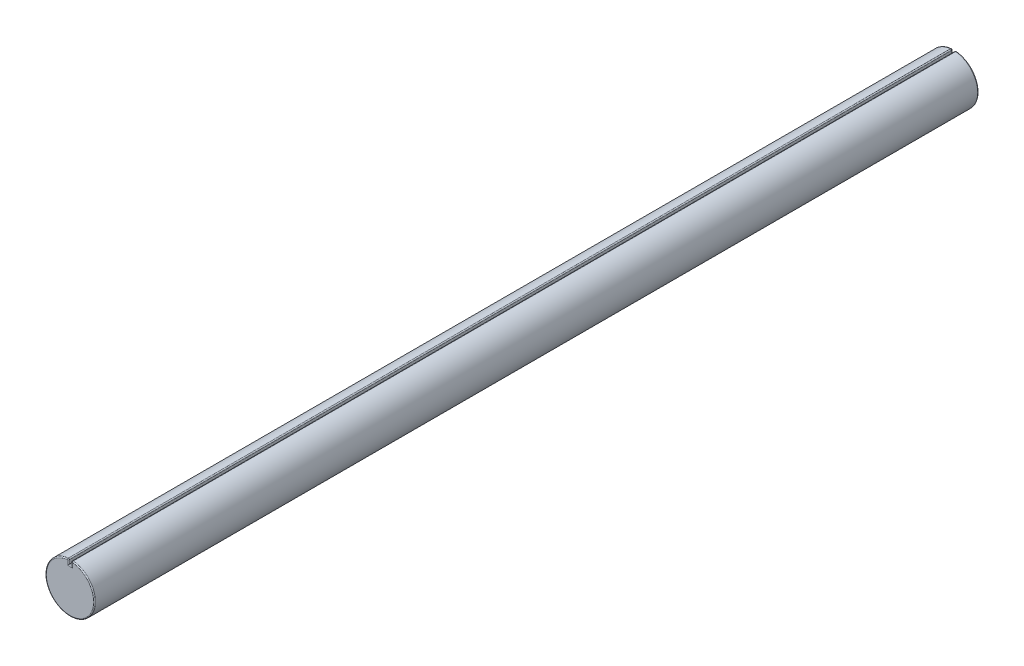
ISO-10303-21;
HEADER;
FILE_DESCRIPTION(('STEP AP214'),'2;1');
FILE_NAME('part.step','',(''),(''),'','','');
FILE_SCHEMA(('AUTOMOTIVE_DESIGN { 1 0 10303 214 1 1 1 1 }'));
ENDSEC;
DATA;
#1=APPLICATION_CONTEXT('core data for automotive mechanical design processes');
#2=APPLICATION_PROTOCOL_DEFINITION('international standard','automotive_design',2000,#1);
#3=PRODUCT_CONTEXT('',#1,'mechanical');
#4=PRODUCT('Part','Part','',(#3));
#5=PRODUCT_RELATED_PRODUCT_CATEGORY('part','',(#4));
#6=PRODUCT_DEFINITION_FORMATION('','',#4);
#7=PRODUCT_DEFINITION_CONTEXT('part definition',#1,'design');
#8=PRODUCT_DEFINITION('design','',#6,#7);
#9=PRODUCT_DEFINITION_SHAPE('','',#8);
#10=(LENGTH_UNIT() NAMED_UNIT(*) SI_UNIT(.MILLI.,.METRE.));
#11=(NAMED_UNIT(*) PLANE_ANGLE_UNIT() SI_UNIT($,.RADIAN.));
#12=(NAMED_UNIT(*) SI_UNIT($,.STERADIAN.) SOLID_ANGLE_UNIT());
#13=UNCERTAINTY_MEASURE_WITH_UNIT(LENGTH_MEASURE(1.E-05),#10,'distance_accuracy_value','');
#14=(GEOMETRIC_REPRESENTATION_CONTEXT(3) GLOBAL_UNCERTAINTY_ASSIGNED_CONTEXT((#13)) GLOBAL_UNIT_ASSIGNED_CONTEXT((#10,
#11,#12)) REPRESENTATION_CONTEXT('',''));
#15=CARTESIAN_POINT('',(0.,0.,0.));
#16=DIRECTION('',(0.,0.,1.));
#17=DIRECTION('',(1.,0.,0.));
#18=AXIS2_PLACEMENT_3D('',#15,#16,#17);
#19=CARTESIAN_POINT('',(0.,0.,900.));
#20=DIRECTION('',(0.,0.,-1.));
#21=DIRECTION('',(-1.,0.,0.));
#22=AXIS2_PLACEMENT_3D('',#19,#20,#21);
#23=CYLINDRICAL_SURFACE('',#22,25.);
#24=DIRECTION('',(0.,0.,-1.));
#25=VECTOR('',#24,1.);
#26=CARTESIAN_POINT('',(-2.60416666666667,24.86399637975,900.));
#27=LINE('',#26,#25);
#28=CARTESIAN_POINT('',(-2.60416666666666,24.86399637975,899.));
#29=VERTEX_POINT('',#28);
#30=CARTESIAN_POINT('',(-2.60416666666666,24.86399637975,1.));
#31=VERTEX_POINT('',#30);
#32=EDGE_CURVE('E45',#29,#31,#27,.T.);
#33=ORIENTED_EDGE('',*,*,#32,.T.);
#34=CARTESIAN_POINT('',(0.,0.,1.));
#35=DIRECTION('',(0.,0.,1.));
#36=DIRECTION('',(1.,0.,0.));
#37=AXIS2_PLACEMENT_3D('',#34,#35,#36);
#38=CIRCLE('',#37,25.);
#39=CARTESIAN_POINT('',(2.60416666666667,24.86399637975,1.));
#40=VERTEX_POINT('',#39);
#41=EDGE_CURVE('E11',#31,#40,#38,.T.);
#42=ORIENTED_EDGE('',*,*,#41,.T.);
#43=DIRECTION('',(0.,0.,-1.));
#44=VECTOR('',#43,1.);
#45=CARTESIAN_POINT('',(2.60416666666667,24.86399637975,900.));
#46=LINE('',#45,#44);
#47=CARTESIAN_POINT('',(2.60416666666667,24.86399637975,899.));
#48=VERTEX_POINT('',#47);
#49=EDGE_CURVE('E179',#40,#48,#46,.F.);
#50=ORIENTED_EDGE('',*,*,#49,.T.);
#51=CARTESIAN_POINT('',(0.,0.,899.));
#52=DIRECTION('',(0.,0.,1.));
#53=DIRECTION('',(1.,0.,0.));
#54=AXIS2_PLACEMENT_3D('',#51,#52,#53);
#55=CIRCLE('',#54,25.);
#56=EDGE_CURVE('E177',#48,#29,#55,.F.);
#57=ORIENTED_EDGE('',*,*,#56,.T.);
#58=EDGE_LOOP('',(#33,#42,#50,#57));
#59=FACE_BOUND('',#58,.T.);
#60=ADVANCED_FACE('F36',(#59),#23,.T.);
#61=CARTESIAN_POINT('',(0.,0.,900.));
#62=DIRECTION('',(0.,0.,1.));
#63=DIRECTION('',(1.,0.,0.));
#64=AXIS2_PLACEMENT_3D('',#61,#62,#63);
#65=PLANE('',#64);
#66=DIRECTION('',(1.,0.,0.));
#67=VECTOR('',#66,1.);
#68=CARTESIAN_POINT('',(-1.5,19.,900.));
#69=LINE('',#68,#67);
#70=CARTESIAN_POINT('',(2.5,19.,900.));
#71=VERTEX_POINT('',#70);
#72=CARTESIAN_POINT('',(-2.5,19.,900.));
#73=VERTEX_POINT('',#72);
#74=EDGE_CURVE('E172',#71,#73,#69,.F.);
#75=ORIENTED_EDGE('',*,*,#74,.T.);
#76=DIRECTION('',(0.,-1.,0.));
#77=VECTOR('',#76,1.);
#78=CARTESIAN_POINT('',(-2.5,24.9549594269356,900.));
#79=LINE('',#78,#77);
#80=CARTESIAN_POINT('',(-2.5,23.86943652456,900.));
#81=VERTEX_POINT('',#80);
#82=EDGE_CURVE('E174',#73,#81,#79,.F.);
#83=ORIENTED_EDGE('',*,*,#82,.T.);
#84=CARTESIAN_POINT('',(0.,0.,900.));
#85=DIRECTION('',(0.,0.,1.));
#86=DIRECTION('',(1.,0.,0.));
#87=AXIS2_PLACEMENT_3D('',#84,#85,#86);
#88=CIRCLE('',#87,24.);
#89=CARTESIAN_POINT('',(2.5,23.86943652456,900.));
#90=VERTEX_POINT('',#89);
#91=EDGE_CURVE('E168',#81,#90,#88,.T.);
#92=ORIENTED_EDGE('',*,*,#91,.T.);
#93=DIRECTION('',(0.,1.,0.));
#94=VECTOR('',#93,1.);
#95=CARTESIAN_POINT('',(2.5,20.,900.));
#96=LINE('',#95,#94);
#97=EDGE_CURVE('E170',#90,#71,#96,.F.);
#98=ORIENTED_EDGE('',*,*,#97,.T.);
#99=EDGE_LOOP('',(#75,#83,#92,#98));
#100=FACE_BOUND('',#99,.T.);
#101=ADVANCED_FACE('F266',(#100),#65,.T.);
#102=CARTESIAN_POINT('',(0.,0.,0.));
#103=DIRECTION('',(0.,0.,1.));
#104=DIRECTION('',(1.,0.,0.));
#105=AXIS2_PLACEMENT_3D('',#102,#103,#104);
#106=PLANE('',#105);
#107=DIRECTION('',(1.,0.,0.));
#108=VECTOR('',#107,1.);
#109=CARTESIAN_POINT('',(0.,19.,0.));
#110=LINE('',#109,#108);
#111=CARTESIAN_POINT('',(-2.5,19.,0.));
#112=VERTEX_POINT('',#111);
#113=CARTESIAN_POINT('',(2.5,19.,0.));
#114=VERTEX_POINT('',#113);
#115=EDGE_CURVE('E120',#112,#114,#110,.T.);
#116=ORIENTED_EDGE('',*,*,#115,.T.);
#117=DIRECTION('',(0.,1.,0.));
#118=VECTOR('',#117,1.);
#119=CARTESIAN_POINT('',(2.50000000000001,0.,0.));
#120=LINE('',#119,#118);
#121=CARTESIAN_POINT('',(2.5,23.86943652456,0.));
#122=VERTEX_POINT('',#121);
#123=EDGE_CURVE('E119',#114,#122,#120,.T.);
#124=ORIENTED_EDGE('',*,*,#123,.T.);
#125=CARTESIAN_POINT('',(0.,0.,0.));
#126=DIRECTION('',(0.,0.,1.));
#127=DIRECTION('',(1.,0.,0.));
#128=AXIS2_PLACEMENT_3D('',#125,#126,#127);
#129=CIRCLE('',#128,24.);
#130=CARTESIAN_POINT('',(-2.5,23.86943652456,0.));
#131=VERTEX_POINT('',#130);
#132=EDGE_CURVE('E113',#122,#131,#129,.F.);
#133=ORIENTED_EDGE('',*,*,#132,.T.);
#134=DIRECTION('',(0.,-1.,0.));
#135=VECTOR('',#134,1.);
#136=CARTESIAN_POINT('',(-2.49999999999999,0.,0.));
#137=LINE('',#136,#135);
#138=EDGE_CURVE('E116',#131,#112,#137,.T.);
#139=ORIENTED_EDGE('',*,*,#138,.T.);
#140=EDGE_LOOP('',(#116,#124,#133,#139));
#141=FACE_BOUND('',#140,.T.);
#142=ADVANCED_FACE('F114',(#141),#106,.F.);
#143=CARTESIAN_POINT('',(1.5,30.,0.));
#144=DIRECTION('',(1.,0.,0.));
#145=DIRECTION('',(0.,1.,0.));
#146=AXIS2_PLACEMENT_3D('',#143,#144,#145);
#147=PLANE('',#146);
#148=DIRECTION('',(0.,0.,-1.));
#149=VECTOR('',#148,1.);
#150=CARTESIAN_POINT('',(1.5,23.86943652456,0.));
#151=LINE('',#150,#149);
#152=CARTESIAN_POINT('',(1.5,23.86943652456,899.));
#153=VERTEX_POINT('',#152);
#154=CARTESIAN_POINT('',(1.5,23.86943652456,1.));
#155=VERTEX_POINT('',#154);
#156=EDGE_CURVE('E151',#153,#155,#151,.T.);
#157=ORIENTED_EDGE('',*,*,#156,.T.);
#158=DIRECTION('',(0.,1.,0.));
#159=VECTOR('',#158,1.);
#160=CARTESIAN_POINT('',(1.5,30.,1.));
#161=LINE('',#160,#159);
#162=CARTESIAN_POINT('',(1.5,20.,1.));
#163=VERTEX_POINT('',#162);
#164=EDGE_CURVE('E155',#155,#163,#161,.F.);
#165=ORIENTED_EDGE('',*,*,#164,.T.);
#166=DIRECTION('',(0.,0.,1.));
#167=VECTOR('',#166,1.);
#168=CARTESIAN_POINT('',(1.5,20.,0.));
#169=LINE('',#168,#167);
#170=CARTESIAN_POINT('',(1.5,20.,899.));
#171=VERTEX_POINT('',#170);
#172=EDGE_CURVE('E142',#163,#171,#169,.T.);
#173=ORIENTED_EDGE('',*,*,#172,.T.);
#174=DIRECTION('',(0.,1.,0.));
#175=VECTOR('',#174,1.);
#176=CARTESIAN_POINT('',(1.5,24.9549594269356,899.));
#177=LINE('',#176,#175);
#178=EDGE_CURVE('E153',#171,#153,#177,.T.);
#179=ORIENTED_EDGE('',*,*,#178,.T.);
#180=EDGE_LOOP('',(#157,#165,#173,#179));
#181=FACE_BOUND('',#180,.T.);
#182=ADVANCED_FACE('F239',(#181),#147,.F.);
#183=CARTESIAN_POINT('',(-1.5,30.,0.));
#184=DIRECTION('',(-1.,0.,0.));
#185=DIRECTION('',(0.,-1.,0.));
#186=AXIS2_PLACEMENT_3D('',#183,#184,#185);
#187=PLANE('',#186);
#188=DIRECTION('',(0.,0.,-1.));
#189=VECTOR('',#188,1.);
#190=CARTESIAN_POINT('',(-1.5,23.86943652456,0.));
#191=LINE('',#190,#189);
#192=CARTESIAN_POINT('',(-1.5,23.86943652456,1.));
#193=VERTEX_POINT('',#192);
#194=CARTESIAN_POINT('',(-1.5,23.86943652456,899.));
#195=VERTEX_POINT('',#194);
#196=EDGE_CURVE('E164',#193,#195,#191,.F.);
#197=ORIENTED_EDGE('',*,*,#196,.T.);
#198=DIRECTION('',(0.,-1.,0.));
#199=VECTOR('',#198,1.);
#200=CARTESIAN_POINT('',(-1.5,20.,899.));
#201=LINE('',#200,#199);
#202=CARTESIAN_POINT('',(-1.5,20.,899.));
#203=VERTEX_POINT('',#202);
#204=EDGE_CURVE('E166',#195,#203,#201,.T.);
#205=ORIENTED_EDGE('',*,*,#204,.T.);
#206=DIRECTION('',(0.,0.,1.));
#207=VECTOR('',#206,1.);
#208=CARTESIAN_POINT('',(-1.5,20.,0.));
#209=LINE('',#208,#207);
#210=CARTESIAN_POINT('',(-1.5,20.,1.));
#211=VERTEX_POINT('',#210);
#212=EDGE_CURVE('E145',#211,#203,#209,.T.);
#213=ORIENTED_EDGE('',*,*,#212,.F.);
#214=DIRECTION('',(0.,-1.,0.));
#215=VECTOR('',#214,1.);
#216=CARTESIAN_POINT('',(-1.5,30.,1.));
#217=LINE('',#216,#215);
#218=EDGE_CURVE('E162',#211,#193,#217,.F.);
#219=ORIENTED_EDGE('',*,*,#218,.T.);
#220=EDGE_LOOP('',(#197,#205,#213,#219));
#221=FACE_BOUND('',#220,.T.);
#222=ADVANCED_FACE('F380',(#221),#187,.F.);
#223=CARTESIAN_POINT('',(-1.5,20.,0.));
#224=DIRECTION('',(0.,-1.,0.));
#225=DIRECTION('',(0.,0.,-1.));
#226=AXIS2_PLACEMENT_3D('',#223,#224,#225);
#227=PLANE('',#226);
#228=ORIENTED_EDGE('',*,*,#172,.F.);
#229=DIRECTION('',(1.,0.,0.));
#230=VECTOR('',#229,1.);
#231=CARTESIAN_POINT('',(-1.5,20.,1.));
#232=LINE('',#231,#230);
#233=EDGE_CURVE('E160',#163,#211,#232,.F.);
#234=ORIENTED_EDGE('',*,*,#233,.T.);
#235=ORIENTED_EDGE('',*,*,#212,.T.);
#236=DIRECTION('',(1.,0.,0.));
#237=VECTOR('',#236,1.);
#238=CARTESIAN_POINT('',(1.5,20.,899.));
#239=LINE('',#238,#237);
#240=EDGE_CURVE('E158',#203,#171,#239,.T.);
#241=ORIENTED_EDGE('',*,*,#240,.T.);
#242=EDGE_LOOP('',(#228,#234,#235,#241));
#243=FACE_BOUND('',#242,.T.);
#244=ADVANCED_FACE('F224',(#243),#227,.F.);
#245=CARTESIAN_POINT('',(-2.5,30.,899.));
#246=DIRECTION('',(0.,1.,0.));
#247=DIRECTION('',(-1.,0.,0.));
#248=AXIS2_PLACEMENT_3D('',#245,#246,#247);
#249=CYLINDRICAL_SURFACE('',#248,1.);
#250=CARTESIAN_POINT('',(-2.5,23.86943652456,899.));
#251=DIRECTION('',(0.,1.,0.));
#252=DIRECTION('',(0.,0.,1.));
#253=AXIS2_PLACEMENT_3D('',#250,#251,#252);
#254=CIRCLE('',#253,1.);
#255=EDGE_CURVE('E40',#81,#195,#254,.T.);
#256=ORIENTED_EDGE('',*,*,#255,.F.);
#257=ORIENTED_EDGE('',*,*,#82,.F.);
#258=CARTESIAN_POINT('',(-2.5,19.,899.));
#259=DIRECTION('',(-0.707106781186548,0.707106781186547,0.));
#260=DIRECTION('',(0.707106781186547,0.707106781186548,0.));
#261=AXIS2_PLACEMENT_3D('',#258,#259,#260);
#262=ELLIPSE('',#261,1.41421356237309,1.);
#263=EDGE_CURVE('E209',#203,#73,#262,.F.);
#264=ORIENTED_EDGE('',*,*,#263,.F.);
#265=ORIENTED_EDGE('',*,*,#204,.F.);
#266=EDGE_LOOP('',(#256,#257,#264,#265));
#267=FACE_BOUND('',#266,.T.);
#268=ADVANCED_FACE('F38',(#267),#249,.T.);
#269=CARTESIAN_POINT('',(-2.5,23.86943652456,899.));
#270=DIRECTION('',(0.,0.,1.));
#271=DIRECTION('',(1.,0.,0.));
#272=AXIS2_PLACEMENT_3D('',#269,#270,#271);
#273=SPHERICAL_SURFACE('',#272,1.);
#274=CARTESIAN_POINT('',(-2.5,23.86943652456,899.));
#275=DIRECTION('',(0.994559855190001,0.104166666666666,0.));
#276=DIRECTION('',(-0.104166666666666,0.994559855190001,0.));
#277=AXIS2_PLACEMENT_3D('',#274,#275,#276);
#278=CIRCLE('',#277,1.);
#279=EDGE_CURVE('E204',#81,#29,#278,.F.);
#280=ORIENTED_EDGE('',*,*,#279,.F.);
#281=ORIENTED_EDGE('',*,*,#255,.T.);
#282=CARTESIAN_POINT('',(-2.5,23.86943652456,899.));
#283=DIRECTION('',(0.,0.,1.));
#284=DIRECTION('',(1.,0.,0.));
#285=AXIS2_PLACEMENT_3D('',#282,#283,#284);
#286=CIRCLE('',#285,1.);
#287=EDGE_CURVE('E207',#29,#195,#286,.F.);
#288=ORIENTED_EDGE('',*,*,#287,.F.);
#289=EDGE_LOOP('',(#280,#281,#288));
#290=FACE_BOUND('',#289,.T.);
#291=ADVANCED_FACE('F360',(#290),#273,.T.);
#292=CARTESIAN_POINT('',(-1.5,19.,899.));
#293=DIRECTION('',(-1.,0.,0.));
#294=DIRECTION('',(0.,0.,1.));
#295=AXIS2_PLACEMENT_3D('',#292,#293,#294);
#296=CYLINDRICAL_SURFACE('',#295,1.);
#297=ORIENTED_EDGE('',*,*,#263,.T.);
#298=ORIENTED_EDGE('',*,*,#74,.F.);
#299=CARTESIAN_POINT('',(2.5,19.,899.));
#300=DIRECTION('',(-0.707106781186547,-0.707106781186548,0.));
#301=DIRECTION('',(-0.707106781186548,0.707106781186547,0.));
#302=AXIS2_PLACEMENT_3D('',#299,#300,#301);
#303=ELLIPSE('',#302,1.4142135623731,1.);
#304=EDGE_CURVE('E201',#171,#71,#303,.F.);
#305=ORIENTED_EDGE('',*,*,#304,.F.);
#306=ORIENTED_EDGE('',*,*,#240,.F.);
#307=EDGE_LOOP('',(#297,#298,#305,#306));
#308=FACE_BOUND('',#307,.T.);
#309=ADVANCED_FACE('F231',(#308),#296,.T.);
#310=CARTESIAN_POINT('',(-2.5,23.86943652456,900.));
#311=DIRECTION('',(0.,0.,-1.));
#312=DIRECTION('',(-1.,0.,0.));
#313=AXIS2_PLACEMENT_3D('',#310,#311,#312);
#314=CYLINDRICAL_SURFACE('',#313,1.);
#315=ORIENTED_EDGE('',*,*,#287,.T.);
#316=ORIENTED_EDGE('',*,*,#196,.F.);
#317=CARTESIAN_POINT('',(-2.5,23.86943652456,1.));
#318=DIRECTION('',(0.,0.,-1.));
#319=DIRECTION('',(-1.,0.,0.));
#320=AXIS2_PLACEMENT_3D('',#317,#318,#319);
#321=CIRCLE('',#320,1.);
#322=EDGE_CURVE('E133',#31,#193,#321,.T.);
#323=ORIENTED_EDGE('',*,*,#322,.F.);
#324=ORIENTED_EDGE('',*,*,#32,.F.);
#325=EDGE_LOOP('',(#315,#316,#323,#324));
#326=FACE_BOUND('',#325,.T.);
#327=ADVANCED_FACE('F344',(#326),#314,.T.);
#328=CARTESIAN_POINT('',(0.,0.,899.));
#329=DIRECTION('',(0.,0.,1.));
#330=DIRECTION('',(1.,0.,0.));
#331=AXIS2_PLACEMENT_3D('',#328,#329,#330);
#332=TOROIDAL_SURFACE('',#331,24.,1.);
#333=ORIENTED_EDGE('',*,*,#279,.T.);
#334=ORIENTED_EDGE('',*,*,#56,.F.);
#335=CARTESIAN_POINT('',(2.5,23.86943652456,899.));
#336=DIRECTION('',(-0.994559855190001,0.104166666666666,0.));
#337=DIRECTION('',(-0.104166666666666,-0.994559855190001,0.));
#338=AXIS2_PLACEMENT_3D('',#335,#336,#337);
#339=CIRCLE('',#338,1.);
#340=EDGE_CURVE('E197',#90,#48,#339,.T.);
#341=ORIENTED_EDGE('',*,*,#340,.F.);
#342=ORIENTED_EDGE('',*,*,#91,.F.);
#343=EDGE_LOOP('',(#333,#334,#341,#342));
#344=FACE_BOUND('',#343,.T.);
#345=ADVANCED_FACE('F254',(#344),#332,.T.);
#346=CARTESIAN_POINT('',(2.5,30.,899.));
#347=DIRECTION('',(0.,-1.,0.));
#348=DIRECTION('',(1.,0.,0.));
#349=AXIS2_PLACEMENT_3D('',#346,#347,#348);
#350=CYLINDRICAL_SURFACE('',#349,1.);
#351=ORIENTED_EDGE('',*,*,#304,.T.);
#352=ORIENTED_EDGE('',*,*,#97,.F.);
#353=CARTESIAN_POINT('',(2.5,23.86943652456,899.));
#354=DIRECTION('',(0.,1.,0.));
#355=DIRECTION('',(0.,0.,1.));
#356=AXIS2_PLACEMENT_3D('',#353,#354,#355);
#357=CIRCLE('',#356,1.);
#358=EDGE_CURVE('E136',#153,#90,#357,.T.);
#359=ORIENTED_EDGE('',*,*,#358,.F.);
#360=ORIENTED_EDGE('',*,*,#178,.F.);
#361=EDGE_LOOP('',(#351,#352,#359,#360));
#362=FACE_BOUND('',#361,.T.);
#363=ADVANCED_FACE('F236',(#362),#350,.T.);
#364=CARTESIAN_POINT('',(-2.5,23.86943652456,1.));
#365=DIRECTION('',(0.,0.,1.));
#366=DIRECTION('',(1.,0.,0.));
#367=AXIS2_PLACEMENT_3D('',#364,#365,#366);
#368=SPHERICAL_SURFACE('',#367,1.);
#369=CARTESIAN_POINT('',(-2.5,23.86943652456,1.));
#370=DIRECTION('',(0.994559855190001,0.104166666666666,0.));
#371=DIRECTION('',(-0.104166666666666,0.994559855190001,0.));
#372=AXIS2_PLACEMENT_3D('',#369,#370,#371);
#373=CIRCLE('',#372,1.);
#374=EDGE_CURVE('E122',#31,#131,#373,.F.);
#375=ORIENTED_EDGE('',*,*,#374,.F.);
#376=ORIENTED_EDGE('',*,*,#322,.T.);
#377=CARTESIAN_POINT('',(-2.5,23.86943652456,1.));
#378=DIRECTION('',(0.,1.,0.));
#379=DIRECTION('',(0.,0.,1.));
#380=AXIS2_PLACEMENT_3D('',#377,#378,#379);
#381=CIRCLE('',#380,1.);
#382=EDGE_CURVE('E128',#131,#193,#381,.F.);
#383=ORIENTED_EDGE('',*,*,#382,.F.);
#384=EDGE_LOOP('',(#375,#376,#383));
#385=FACE_BOUND('',#384,.T.);
#386=ADVANCED_FACE('F132',(#385),#368,.T.);
#387=CARTESIAN_POINT('',(2.5,23.86943652456,899.));
#388=DIRECTION('',(0.,0.,1.));
#389=DIRECTION('',(1.,0.,0.));
#390=AXIS2_PLACEMENT_3D('',#387,#388,#389);
#391=SPHERICAL_SURFACE('',#390,1.);
#392=ORIENTED_EDGE('',*,*,#358,.T.);
#393=ORIENTED_EDGE('',*,*,#340,.T.);
#394=CARTESIAN_POINT('',(2.5,23.86943652456,899.));
#395=DIRECTION('',(0.,0.,1.));
#396=DIRECTION('',(1.,0.,0.));
#397=AXIS2_PLACEMENT_3D('',#394,#395,#396);
#398=CIRCLE('',#397,1.);
#399=EDGE_CURVE('E129',#153,#48,#398,.F.);
#400=ORIENTED_EDGE('',*,*,#399,.F.);
#401=EDGE_LOOP('',(#392,#393,#400));
#402=FACE_BOUND('',#401,.T.);
#403=ADVANCED_FACE('F256',(#402),#391,.T.);
#404=CARTESIAN_POINT('',(-2.49999999999999,0.,1.));
#405=DIRECTION('',(0.,-1.,0.));
#406=DIRECTION('',(1.,0.,0.));
#407=AXIS2_PLACEMENT_3D('',#404,#405,#406);
#408=CYLINDRICAL_SURFACE('',#407,1.);
#409=ORIENTED_EDGE('',*,*,#382,.T.);
#410=ORIENTED_EDGE('',*,*,#218,.F.);
#411=CARTESIAN_POINT('',(-2.5,19.,1.));
#412=DIRECTION('',(0.707106781186548,-0.707106781186547,0.));
#413=DIRECTION('',(0.707106781186547,0.707106781186548,0.));
#414=AXIS2_PLACEMENT_3D('',#411,#412,#413);
#415=ELLIPSE('',#414,1.41421356237309,1.);
#416=EDGE_CURVE('E140',#112,#211,#415,.T.);
#417=ORIENTED_EDGE('',*,*,#416,.F.);
#418=ORIENTED_EDGE('',*,*,#138,.F.);
#419=EDGE_LOOP('',(#409,#410,#417,#418));
#420=FACE_BOUND('',#419,.T.);
#421=ADVANCED_FACE('F138',(#420),#408,.T.);
#422=CARTESIAN_POINT('',(0.,0.,1.));
#423=DIRECTION('',(0.,0.,1.));
#424=DIRECTION('',(1.,0.,0.));
#425=AXIS2_PLACEMENT_3D('',#422,#423,#424);
#426=TOROIDAL_SURFACE('',#425,24.,1.);
#427=ORIENTED_EDGE('',*,*,#374,.T.);
#428=ORIENTED_EDGE('',*,*,#132,.F.);
#429=CARTESIAN_POINT('',(2.5,23.86943652456,1.));
#430=DIRECTION('',(-0.994559855190001,0.104166666666667,0.));
#431=DIRECTION('',(-0.104166666666667,-0.994559855190001,0.));
#432=AXIS2_PLACEMENT_3D('',#429,#430,#431);
#433=CIRCLE('',#432,1.);
#434=EDGE_CURVE('E189',#40,#122,#433,.T.);
#435=ORIENTED_EDGE('',*,*,#434,.F.);
#436=ORIENTED_EDGE('',*,*,#41,.F.);
#437=EDGE_LOOP('',(#427,#428,#435,#436));
#438=FACE_BOUND('',#437,.T.);
#439=ADVANCED_FACE('F124',(#438),#426,.T.);
#440=CARTESIAN_POINT('',(2.5,23.86943652456,900.));
#441=DIRECTION('',(0.,0.,-1.));
#442=DIRECTION('',(-1.,0.,0.));
#443=AXIS2_PLACEMENT_3D('',#440,#441,#442);
#444=CYLINDRICAL_SURFACE('',#443,1.);
#445=ORIENTED_EDGE('',*,*,#399,.T.);
#446=ORIENTED_EDGE('',*,*,#49,.F.);
#447=CARTESIAN_POINT('',(2.5,23.86943652456,1.));
#448=DIRECTION('',(0.,0.,-1.));
#449=DIRECTION('',(0.,1.,0.));
#450=AXIS2_PLACEMENT_3D('',#447,#448,#449);
#451=CIRCLE('',#450,1.);
#452=EDGE_CURVE('E186',#155,#40,#451,.T.);
#453=ORIENTED_EDGE('',*,*,#452,.F.);
#454=ORIENTED_EDGE('',*,*,#156,.F.);
#455=EDGE_LOOP('',(#445,#446,#453,#454));
#456=FACE_BOUND('',#455,.T.);
#457=ADVANCED_FACE('F250',(#456),#444,.T.);
#458=CARTESIAN_POINT('',(0.,19.,1.));
#459=DIRECTION('',(1.,0.,0.));
#460=DIRECTION('',(0.,0.,-1.));
#461=AXIS2_PLACEMENT_3D('',#458,#459,#460);
#462=CYLINDRICAL_SURFACE('',#461,1.);
#463=ORIENTED_EDGE('',*,*,#416,.T.);
#464=ORIENTED_EDGE('',*,*,#233,.F.);
#465=CARTESIAN_POINT('',(2.5,19.,1.));
#466=DIRECTION('',(0.707106781186547,0.707106781186548,0.));
#467=DIRECTION('',(-0.707106781186548,0.707106781186547,0.));
#468=AXIS2_PLACEMENT_3D('',#465,#466,#467);
#469=ELLIPSE('',#468,1.4142135623731,1.);
#470=EDGE_CURVE('E184',#114,#163,#469,.T.);
#471=ORIENTED_EDGE('',*,*,#470,.F.);
#472=ORIENTED_EDGE('',*,*,#115,.F.);
#473=EDGE_LOOP('',(#463,#464,#471,#472));
#474=FACE_BOUND('',#473,.T.);
#475=ADVANCED_FACE('F279',(#474),#462,.T.);
#476=CARTESIAN_POINT('',(2.5,23.86943652456,1.));
#477=DIRECTION('',(0.,0.,1.));
#478=DIRECTION('',(1.,0.,0.));
#479=AXIS2_PLACEMENT_3D('',#476,#477,#478);
#480=SPHERICAL_SURFACE('',#479,1.);
#481=ORIENTED_EDGE('',*,*,#452,.T.);
#482=ORIENTED_EDGE('',*,*,#434,.T.);
#483=CARTESIAN_POINT('',(2.5,23.86943652456,1.));
#484=DIRECTION('',(0.,1.,0.));
#485=DIRECTION('',(0.,0.,1.));
#486=AXIS2_PLACEMENT_3D('',#483,#484,#485);
#487=CIRCLE('',#486,1.);
#488=EDGE_CURVE('E182',#155,#122,#487,.F.);
#489=ORIENTED_EDGE('',*,*,#488,.F.);
#490=EDGE_LOOP('',(#481,#482,#489));
#491=FACE_BOUND('',#490,.T.);
#492=ADVANCED_FACE('F248',(#491),#480,.T.);
#493=CARTESIAN_POINT('',(2.50000000000001,0.,1.));
#494=DIRECTION('',(0.,1.,0.));
#495=DIRECTION('',(-1.,0.,0.));
#496=AXIS2_PLACEMENT_3D('',#493,#494,#495);
#497=CYLINDRICAL_SURFACE('',#496,1.);
#498=ORIENTED_EDGE('',*,*,#470,.T.);
#499=ORIENTED_EDGE('',*,*,#164,.F.);
#500=ORIENTED_EDGE('',*,*,#488,.T.);
#501=ORIENTED_EDGE('',*,*,#123,.F.);
#502=EDGE_LOOP('',(#498,#499,#500,#501));
#503=FACE_BOUND('',#502,.T.);
#504=ADVANCED_FACE('F245',(#503),#497,.T.);
#505=CLOSED_SHELL('',(#60,#101,#142,#182,#222,#244,#268,#291,#309,#327,#345,#363,#386,#403,#421,
#439,#457,#475,#492,#504));
#506=MANIFOLD_SOLID_BREP('B2',#505);
#507=ADVANCED_BREP_SHAPE_REPRESENTATION('',(#18,#506),#14);
#508=SHAPE_DEFINITION_REPRESENTATION(#9,#507);
ENDSEC;
END-ISO-10303-21;
